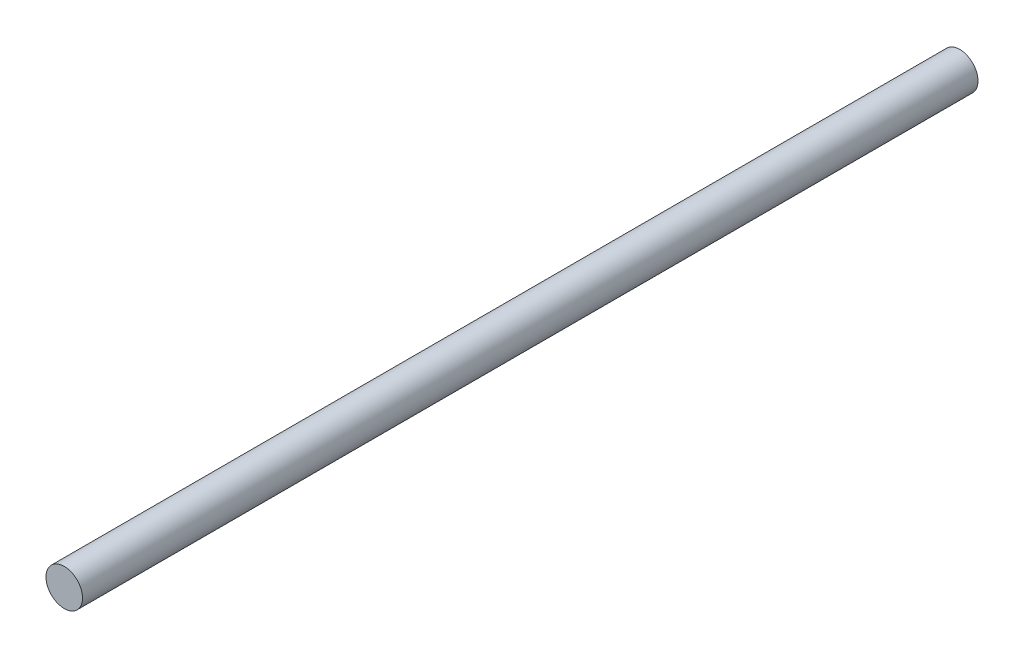
ISO-10303-21;
HEADER;
FILE_DESCRIPTION(('STEP AP214'),'2;1');
FILE_NAME('part.step','',(''),(''),'','','');
FILE_SCHEMA(('AUTOMOTIVE_DESIGN { 1 0 10303 214 1 1 1 1 }'));
ENDSEC;
DATA;
#1=APPLICATION_CONTEXT('core data for automotive mechanical design processes');
#2=APPLICATION_PROTOCOL_DEFINITION('international standard','automotive_design',2000,#1);
#3=PRODUCT_CONTEXT('',#1,'mechanical');
#4=PRODUCT('Part','Part','',(#3));
#5=PRODUCT_RELATED_PRODUCT_CATEGORY('part','',(#4));
#6=PRODUCT_DEFINITION_FORMATION('','',#4);
#7=PRODUCT_DEFINITION_CONTEXT('part definition',#1,'design');
#8=PRODUCT_DEFINITION('design','',#6,#7);
#9=PRODUCT_DEFINITION_SHAPE('','',#8);
#10=(LENGTH_UNIT() NAMED_UNIT(*) SI_UNIT(.MILLI.,.METRE.));
#11=(NAMED_UNIT(*) PLANE_ANGLE_UNIT() SI_UNIT($,.RADIAN.));
#12=(NAMED_UNIT(*) SI_UNIT($,.STERADIAN.) SOLID_ANGLE_UNIT());
#13=UNCERTAINTY_MEASURE_WITH_UNIT(LENGTH_MEASURE(1.E-05),#10,'distance_accuracy_value','');
#14=(GEOMETRIC_REPRESENTATION_CONTEXT(3) GLOBAL_UNCERTAINTY_ASSIGNED_CONTEXT((#13)) GLOBAL_UNIT_ASSIGNED_CONTEXT((#10,
#11,#12)) REPRESENTATION_CONTEXT('',''));
#15=CARTESIAN_POINT('',(0.,0.,0.));
#16=DIRECTION('',(0.,0.,1.));
#17=DIRECTION('',(1.,0.,0.));
#18=AXIS2_PLACEMENT_3D('',#15,#16,#17);
#19=CARTESIAN_POINT('',(0.,0.,196.));
#20=DIRECTION('',(0.,0.,-1.));
#21=DIRECTION('',(-1.,0.,0.));
#22=AXIS2_PLACEMENT_3D('',#19,#20,#21);
#23=CYLINDRICAL_SURFACE('',#22,4.);
#24=CARTESIAN_POINT('',(0.,0.,196.));
#25=DIRECTION('',(0.,0.,1.));
#26=DIRECTION('',(1.,0.,0.));
#27=AXIS2_PLACEMENT_3D('',#24,#25,#26);
#28=CIRCLE('',#27,4.);
#29=CARTESIAN_POINT('',(4.,0.,196.));
#30=VERTEX_POINT('',#29);
#31=EDGE_CURVE('E10',#30,#30,#28,.T.);
#32=ORIENTED_EDGE('',*,*,#31,.F.);
#33=EDGE_LOOP('',(#32));
#34=FACE_BOUND('',#33,.T.);
#35=CARTESIAN_POINT('',(0.,0.,0.));
#36=DIRECTION('',(0.,0.,1.));
#37=DIRECTION('',(1.,0.,0.));
#38=AXIS2_PLACEMENT_3D('',#35,#36,#37);
#39=CIRCLE('',#38,4.);
#40=CARTESIAN_POINT('',(4.,0.,0.));
#41=VERTEX_POINT('',#40);
#42=EDGE_CURVE('E34',#41,#41,#39,.T.);
#43=ORIENTED_EDGE('',*,*,#42,.T.);
#44=EDGE_LOOP('',(#43));
#45=FACE_BOUND('',#44,.T.);
#46=ADVANCED_FACE('F31',(#34,#45),#23,.T.);
#47=CARTESIAN_POINT('',(0.,0.,196.));
#48=DIRECTION('',(0.,0.,1.));
#49=DIRECTION('',(1.,0.,0.));
#50=AXIS2_PLACEMENT_3D('',#47,#48,#49);
#51=PLANE('',#50);
#52=ORIENTED_EDGE('',*,*,#31,.T.);
#53=EDGE_LOOP('',(#52));
#54=FACE_BOUND('',#53,.T.);
#55=ADVANCED_FACE('F46',(#54),#51,.T.);
#56=CARTESIAN_POINT('',(0.,0.,0.));
#57=DIRECTION('',(0.,0.,1.));
#58=DIRECTION('',(1.,0.,0.));
#59=AXIS2_PLACEMENT_3D('',#56,#57,#58);
#60=PLANE('',#59);
#61=ORIENTED_EDGE('',*,*,#42,.F.);
#62=EDGE_LOOP('',(#61));
#63=FACE_BOUND('',#62,.T.);
#64=ADVANCED_FACE('F44',(#63),#60,.F.);
#65=CLOSED_SHELL('',(#46,#55,#64));
#66=MANIFOLD_SOLID_BREP('B2',#65);
#67=ADVANCED_BREP_SHAPE_REPRESENTATION('',(#18,#66),#14);
#68=SHAPE_DEFINITION_REPRESENTATION(#9,#67);
ENDSEC;
END-ISO-10303-21;
